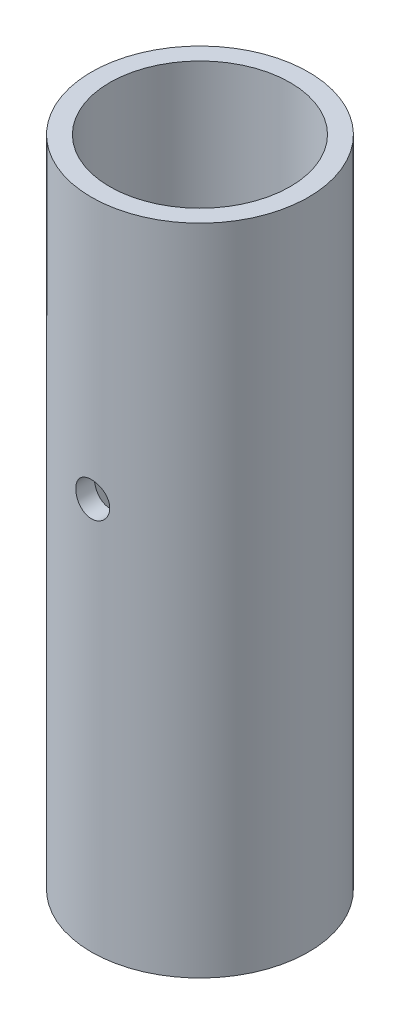
ISO-10303-21;
HEADER;
FILE_DESCRIPTION(('STEP AP214'),'2;1');
FILE_NAME('part.step','',(''),(''),'','','');
FILE_SCHEMA(('AUTOMOTIVE_DESIGN { 1 0 10303 214 1 1 1 1 }'));
ENDSEC;
DATA;
#1=APPLICATION_CONTEXT('core data for automotive mechanical design processes');
#2=APPLICATION_PROTOCOL_DEFINITION('international standard','automotive_design',2000,#1);
#3=PRODUCT_CONTEXT('',#1,'mechanical');
#4=PRODUCT('Part','Part','',(#3));
#5=PRODUCT_RELATED_PRODUCT_CATEGORY('part','',(#4));
#6=PRODUCT_DEFINITION_FORMATION('','',#4);
#7=PRODUCT_DEFINITION_CONTEXT('part definition',#1,'design');
#8=PRODUCT_DEFINITION('design','',#6,#7);
#9=PRODUCT_DEFINITION_SHAPE('','',#8);
#10=(LENGTH_UNIT() NAMED_UNIT(*) SI_UNIT(.MILLI.,.METRE.));
#11=(NAMED_UNIT(*) PLANE_ANGLE_UNIT() SI_UNIT($,.RADIAN.));
#12=(NAMED_UNIT(*) SI_UNIT($,.STERADIAN.) SOLID_ANGLE_UNIT());
#13=UNCERTAINTY_MEASURE_WITH_UNIT(LENGTH_MEASURE(1.E-05),#10,'distance_accuracy_value','');
#14=(GEOMETRIC_REPRESENTATION_CONTEXT(3) GLOBAL_UNCERTAINTY_ASSIGNED_CONTEXT((#13)) GLOBAL_UNIT_ASSIGNED_CONTEXT((#10,
#11,#12)) REPRESENTATION_CONTEXT('',''));
#15=CARTESIAN_POINT('',(0.,0.,0.));
#16=DIRECTION('',(0.,0.,1.));
#17=DIRECTION('',(1.,0.,0.));
#18=AXIS2_PLACEMENT_3D('',#15,#16,#17);
#19=CARTESIAN_POINT('',(0.,76.2,25.2984));
#20=DIRECTION('',(0.,0.,-1.));
#21=DIRECTION('',(-1.,0.,0.));
#22=AXIS2_PLACEMENT_3D('',#19,#20,#21);
#23=CYLINDRICAL_SURFACE('',#22,3.302);
#24=CARTESIAN_POINT('',(3.302,76.2,17.212131535635));
#25=CARTESIAN_POINT('',(3.30199130007002,76.0164871813546,17.2121357912959));
#26=CARTESIAN_POINT('',(3.28663585313906,75.8327439878626,17.2151010141485));
#27=CARTESIAN_POINT('',(3.22562147458273,75.4702961854619,17.2266354162427));
#28=CARTESIAN_POINT('',(3.17990188170017,75.2916024107881,17.235215812932));
#29=CARTESIAN_POINT('',(3.05960981849083,74.9447641031004,17.2569745758185));
#30=CARTESIAN_POINT('',(2.98507722350842,74.776605362395,17.2701465850535));
#31=CARTESIAN_POINT('',(2.80936907233875,74.4552393196757,17.2995959096477));
#32=CARTESIAN_POINT('',(2.70820265297164,74.3020269149291,17.3158721595603));
#33=CARTESIAN_POINT('',(2.48072155818345,74.0128922096604,17.3499290051584));
#34=CARTESIAN_POINT('',(2.35413406488901,73.8771862687002,17.3677245991603));
#35=CARTESIAN_POINT('',(2.07998787720683,73.6287991620913,17.4026833164607));
#36=CARTESIAN_POINT('',(1.93242669927012,73.5161207270474,17.4198463645542));
#37=CARTESIAN_POINT('',(1.61912172583027,73.3161758225405,17.4517639888191));
#38=CARTESIAN_POINT('',(1.45324708551853,73.2291110024161,17.4664990714187));
#39=CARTESIAN_POINT('',(1.10890232271858,73.0841652145225,17.4917344998527));
#40=CARTESIAN_POINT('',(0.930433354973723,73.0262815751546,17.5022352333331));
#41=CARTESIAN_POINT('',(0.568185677153312,72.9420031161057,17.5177140797912));
#42=CARTESIAN_POINT('',(0.384493776564784,72.9152469916724,17.5227555116936));
#43=CARTESIAN_POINT('',(0.0151634313080578,72.8928572174964,17.5269660010195));
#44=CARTESIAN_POINT('',(-0.170474847849683,72.8972209425663,17.526135553779));
#45=CARTESIAN_POINT('',(-0.535948321762245,72.9366700400711,17.5187453165642));
#46=CARTESIAN_POINT('',(-0.715827218444372,72.9713661073525,17.5122581315663));
#47=CARTESIAN_POINT('',(-1.06716471944178,73.0698796318034,17.4943647240374));
#48=CARTESIAN_POINT('',(-1.23862294887289,73.1336983842019,17.4829582827243));
#49=CARTESIAN_POINT('',(-1.56938357210161,73.2890182445264,17.4563863678042));
#50=CARTESIAN_POINT('',(-1.72861081598389,73.3806756240815,17.4411997634979));
#51=CARTESIAN_POINT('',(-2.02955810161077,73.588948478513,17.4087481619631));
#52=CARTESIAN_POINT('',(-2.1712776543047,73.7055646503267,17.3914831067029));
#53=CARTESIAN_POINT('',(-2.4354828311894,73.9625666232612,17.35647319222));
#54=CARTESIAN_POINT('',(-2.55764096472366,74.1032888322442,17.3387250336484));
#55=CARTESIAN_POINT('',(-2.77672597148959,74.4034676115724,17.3049934941075));
#56=CARTESIAN_POINT('',(-2.87364158354753,74.5629324975044,17.2890109026162));
#57=CARTESIAN_POINT('',(-3.03957910177399,74.8965509753187,17.2606131954961));
#58=CARTESIAN_POINT('',(-3.10853019051617,75.0707405259617,17.248207159813));
#59=CARTESIAN_POINT('',(-3.21595739527462,75.4282930881176,17.2285032482303));
#60=CARTESIAN_POINT('',(-3.25449780559778,75.6116358699164,17.2211945992487));
#61=CARTESIAN_POINT('',(-3.2855165099523,75.8636254808596,17.2152867144043));
#62=CARTESIAN_POINT('',(-3.29169262178811,75.9307373186883,17.2141062438161));
#63=CARTESIAN_POINT('',(-3.29993596755384,76.0652224108313,17.2125278723074));
#64=CARTESIAN_POINT('',(-3.30200319548789,76.132595665527,17.2121299725289));
#65=CARTESIAN_POINT('',(-3.30199130007002,76.3835128186454,17.2121357912959));
#66=CARTESIAN_POINT('',(-3.28663585313906,76.5672560121374,17.2151010141485));
#67=CARTESIAN_POINT('',(-3.22562147458273,76.9297038145381,17.2266354162427));
#68=CARTESIAN_POINT('',(-3.17990188170017,77.1083975892119,17.235215812932));
#69=CARTESIAN_POINT('',(-3.05960981849083,77.4552358968996,17.2569745758185));
#70=CARTESIAN_POINT('',(-2.98507722350842,77.623394637605,17.2701465850535));
#71=CARTESIAN_POINT('',(-2.80936907233875,77.9447606803243,17.2995959096477));
#72=CARTESIAN_POINT('',(-2.70820265297164,78.0979730850709,17.3158721595603));
#73=CARTESIAN_POINT('',(-2.48072155818345,78.3871077903396,17.3499290051584));
#74=CARTESIAN_POINT('',(-2.35413406488901,78.5228137312997,17.3677245991603));
#75=CARTESIAN_POINT('',(-2.07998787720683,78.7712008379087,17.4026833164607));
#76=CARTESIAN_POINT('',(-1.93242669927012,78.8838792729526,17.4198463645542));
#77=CARTESIAN_POINT('',(-1.61912172583027,79.0838241774595,17.4517639888191));
#78=CARTESIAN_POINT('',(-1.45324708551853,79.1708889975839,17.4664990714187));
#79=CARTESIAN_POINT('',(-1.10890232271858,79.3158347854775,17.4917344998527));
#80=CARTESIAN_POINT('',(-0.930433354973723,79.3737184248454,17.5022352333331));
#81=CARTESIAN_POINT('',(-0.568185677153312,79.4579968838943,17.5177140797912));
#82=CARTESIAN_POINT('',(-0.384493776564784,79.4847530083275,17.5227555116936));
#83=CARTESIAN_POINT('',(-0.015163431308058,79.5071427825036,17.5269660010195));
#84=CARTESIAN_POINT('',(0.170474847849683,79.5027790574336,17.526135553779));
#85=CARTESIAN_POINT('',(0.535948321762244,79.4633299599289,17.5187453165642));
#86=CARTESIAN_POINT('',(0.71582721844437,79.4286338926475,17.5122581315663));
#87=CARTESIAN_POINT('',(1.06716471944178,79.3301203681966,17.4943647240374));
#88=CARTESIAN_POINT('',(1.23862294887289,79.2663016157981,17.4829582827243));
#89=CARTESIAN_POINT('',(1.56938357210161,79.1109817554736,17.4563863678042));
#90=CARTESIAN_POINT('',(1.72861081598389,79.0193243759185,17.4411997634979));
#91=CARTESIAN_POINT('',(2.02955810161077,78.811051521487,17.4087481619631));
#92=CARTESIAN_POINT('',(2.1712776543047,78.6944353496733,17.3914831067029));
#93=CARTESIAN_POINT('',(2.4354828311894,78.4374333767388,17.35647319222));
#94=CARTESIAN_POINT('',(2.55764096472366,78.2967111677557,17.3387250336484));
#95=CARTESIAN_POINT('',(2.77672597148959,77.9965323884276,17.3049934941075));
#96=CARTESIAN_POINT('',(2.87364158354753,77.8370675024956,17.2890109026162));
#97=CARTESIAN_POINT('',(3.03957910177399,77.5034490246813,17.2606131954961));
#98=CARTESIAN_POINT('',(3.10853019051617,77.3292594740383,17.248207159813));
#99=CARTESIAN_POINT('',(3.21595739527462,76.9717069118823,17.2285032482303));
#100=CARTESIAN_POINT('',(3.25449780559778,76.7883641300836,17.2211945992487));
#101=CARTESIAN_POINT('',(3.2855165099523,76.5363745191404,17.2152867144043));
#102=CARTESIAN_POINT('',(3.29169262178811,76.4692626813117,17.2141062438161));
#103=CARTESIAN_POINT('',(3.29993596755384,76.3347775891687,17.2125278723074));
#104=CARTESIAN_POINT('',(3.30200319548789,76.267404334473,17.2121299725289));
#105=CARTESIAN_POINT('',(3.302,76.2,17.212131535635));
#106=B_SPLINE_CURVE_WITH_KNOTS('',3,(#24,#25,#26,#27,#28,#29,#30,#31,#32,#33,#34,#35,#36,#37,
#38,#39,#40,#41,#42,#43,#44,#45,#46,#47,#48,#49,#50,#51,#52,#53,#54,#55,#56,#57,#58,#59,#60,#61,
#62,#63,#64,#65,#66,#67,#68,#69,#70,#71,#72,#73,#74,#75,#76,#77,#78,#79,#80,#81,#82,#83,#84,#85,
#86,#87,#88,#89,#90,#91,#92,#93,#94,#95,#96,#97,#98,#99,#100,#101,#102,#103,#104,#105),
.UNSPECIFIED.,.T.,.F.,(4,2,2,2,2,2,2,2,2,2,2,2,2,2,2,2,2,2,2,2,2,2,2,2,2,2,2,2,2,2,2,2,2,2,2,2,
2,2,2,2,4),(0.,0.550280728118776,1.1016641231347,1.65228715504278,2.20272153951086,
2.75941341573735,3.31617126630994,3.87720172279344,4.4381808064211,4.99258136898155,
5.5469351643474,6.0942767793971,6.64164273979224,7.19213997066774,7.74265257536888,
8.30158887354543,8.86077409849182,9.42136669374738,9.98077088361991,10.1828889285657,
10.3850072684503,10.9352879965691,11.486671391585,12.0372944234931,12.5877288079612,
13.1444206841877,13.7011785347603,14.2622089912438,14.8231880748714,15.3775886374319,
15.9319424327977,16.4792840478474,17.0266500082426,17.5771472391181,18.1276598438192,
18.6865961419958,19.2457813669421,19.8063739621977,20.3657781520702,20.567896197016,
20.7700145369006),.UNSPECIFIED.);
#107=CARTESIAN_POINT('',(3.302,76.2,17.212131535635));
#108=VERTEX_POINT('',#107);
#109=EDGE_CURVE('E19',#108,#108,#106,.T.);
#110=ORIENTED_EDGE('',*,*,#109,.T.);
#111=EDGE_LOOP('',(#110));
#112=FACE_BOUND('',#111,.T.);
#113=CARTESIAN_POINT('',(-3.302,76.2,20.8218039564299));
#114=CARTESIAN_POINT('',(-3.30199160753357,76.3840729881841,20.8218073806267));
#115=CARTESIAN_POINT('',(-3.28654301260894,76.5683826280437,20.8242733684239));
#116=CARTESIAN_POINT('',(-3.22514065789151,76.9319773809362,20.8338695525104));
#117=CARTESIAN_POINT('',(-3.17912451730725,77.1112514361911,20.8410092863234));
#118=CARTESIAN_POINT('',(-3.05799853788291,77.4592582036655,20.8591249107495));
#119=CARTESIAN_POINT('',(-2.9829239644666,77.6280034065927,20.870096149862));
#120=CARTESIAN_POINT('',(-2.80588978432558,77.9504319595423,20.8946321673489));
#121=CARTESIAN_POINT('',(-2.7039404616579,78.104121040242,20.9081959530987));
#122=CARTESIAN_POINT('',(-2.47508070345098,78.3935072758243,20.9365245741082));
#123=CARTESIAN_POINT('',(-2.34797939326253,78.5290526638276,20.9512980530242));
#124=CARTESIAN_POINT('',(-2.07283012487502,78.7769904673666,20.9803050551998));
#125=CARTESIAN_POINT('',(-1.92477991142582,78.8893803869011,20.9945385201148));
#126=CARTESIAN_POINT('',(-1.6109795917043,79.0883630305796,21.0209503025573));
#127=CARTESIAN_POINT('',(-1.44514095474079,79.1748177447445,21.0331174809926));
#128=CARTESIAN_POINT('',(-1.10107506605374,79.3185885256555,21.05393135813));
#129=CARTESIAN_POINT('',(-0.922848635277752,79.3759065212229,21.0625782898611));
#130=CARTESIAN_POINT('',(-0.560609603386695,79.4593222998533,21.0753173636847));
#131=CARTESIAN_POINT('',(-0.376656148144354,79.4856712441195,21.0794461292818));
#132=CARTESIAN_POINT('',(-0.00689553053005387,79.5071812576626,21.0828093145542));
#133=CARTESIAN_POINT('',(0.178911522424525,79.5023441570935,21.0820440214374));
#134=CARTESIAN_POINT('',(0.545387987681637,79.4618167775211,21.07573448412));
#135=CARTESIAN_POINT('',(0.726088139323015,79.4263970120159,21.0702321418829));
#136=CARTESIAN_POINT('',(1.07894959112666,79.3261343568065,21.0551133735714));
#137=CARTESIAN_POINT('',(1.25111058419742,79.261290409778,21.0454967996575));
#138=CARTESIAN_POINT('',(1.58282366581658,79.1037438111656,21.0231579611584));
#139=CARTESIAN_POINT('',(1.74232079287567,79.0109273061887,21.0104230448454));
#140=CARTESIAN_POINT('',(2.04356567709641,78.8001612752758,20.983266477008));
#141=CARTESIAN_POINT('',(2.18531354855578,78.6822119111981,20.9688448363465));
#142=CARTESIAN_POINT('',(2.44862169860154,78.4230472614397,20.9397407137842));
#143=CARTESIAN_POINT('',(2.56995357233259,78.2815999631653,20.925057084518));
#144=CARTESIAN_POINT('',(2.78725086621637,77.9801582635446,20.8972247356282));
#145=CARTESIAN_POINT('',(2.8832048216977,77.8201555264266,20.8840767112186));
#146=CARTESIAN_POINT('',(3.04705056434819,77.4858532883372,20.8608028211873));
#147=CARTESIAN_POINT('',(3.11489418988142,77.3115298587399,20.8506821505325));
#148=CARTESIAN_POINT('',(3.22013679209878,76.9539992542655,20.8346903229562));
#149=CARTESIAN_POINT('',(3.25760012468806,76.7708117341165,20.828810186069));
#150=CARTESIAN_POINT('',(3.28690487349376,76.5219300514406,20.8241928990953));
#151=CARTESIAN_POINT('',(3.29256105712587,76.4576857182853,20.8232989883506));
#152=CARTESIAN_POINT('',(3.30011009230049,76.3289706091185,20.8221039168489));
#153=CARTESIAN_POINT('',(3.30200294075023,76.2644998329209,20.8218027565791));
#154=CARTESIAN_POINT('',(3.30199160753357,76.0159270118159,20.8218073806267));
#155=CARTESIAN_POINT('',(3.28654301260894,75.8316173719563,20.8242733684239));
#156=CARTESIAN_POINT('',(3.22514065789151,75.4680226190638,20.8338695525104));
#157=CARTESIAN_POINT('',(3.17912451730725,75.2887485638089,20.8410092863234));
#158=CARTESIAN_POINT('',(3.05799853788291,74.9407417963344,20.8591249107495));
#159=CARTESIAN_POINT('',(2.9829239644666,74.7719965934073,20.870096149862));
#160=CARTESIAN_POINT('',(2.80588978432558,74.4495680404577,20.8946321673489));
#161=CARTESIAN_POINT('',(2.7039404616579,74.2958789597579,20.9081959530987));
#162=CARTESIAN_POINT('',(2.47508070345098,74.0064927241757,20.9365245741082));
#163=CARTESIAN_POINT('',(2.34797939326253,73.8709473361724,20.9512980530242));
#164=CARTESIAN_POINT('',(2.07283012487502,73.6230095326334,20.9803050551998));
#165=CARTESIAN_POINT('',(1.92477991142582,73.5106196130989,20.9945385201148));
#166=CARTESIAN_POINT('',(1.6109795917043,73.3116369694203,21.0209503025573));
#167=CARTESIAN_POINT('',(1.44514095474079,73.2251822552555,21.0331174809926));
#168=CARTESIAN_POINT('',(1.10107506605374,73.0814114743445,21.05393135813));
#169=CARTESIAN_POINT('',(0.922848635277752,73.024093478777,21.0625782898611));
#170=CARTESIAN_POINT('',(0.560609603386695,72.9406777001467,21.0753173636847));
#171=CARTESIAN_POINT('',(0.376656148144354,72.9143287558805,21.0794461292818));
#172=CARTESIAN_POINT('',(0.00689553053005382,72.8928187423374,21.0828093145542));
#173=CARTESIAN_POINT('',(-0.178911522424526,72.8976558429065,21.0820440214374));
#174=CARTESIAN_POINT('',(-0.545387987681637,72.9381832224789,21.07573448412));
#175=CARTESIAN_POINT('',(-0.726088139323015,72.9736029879841,21.0702321418829));
#176=CARTESIAN_POINT('',(-1.07894959112666,73.0738656431935,21.0551133735714));
#177=CARTESIAN_POINT('',(-1.25111058419742,73.1387095902219,21.0454967996575));
#178=CARTESIAN_POINT('',(-1.58282366581658,73.2962561888343,21.0231579611584));
#179=CARTESIAN_POINT('',(-1.74232079287567,73.3890726938112,21.0104230448454));
#180=CARTESIAN_POINT('',(-2.04356567709641,73.5998387247241,20.983266477008));
#181=CARTESIAN_POINT('',(-2.18531354855578,73.7177880888019,20.9688448363465));
#182=CARTESIAN_POINT('',(-2.44862169860154,73.9769527385603,20.9397407137842));
#183=CARTESIAN_POINT('',(-2.5699535723326,74.1184000368347,20.925057084518));
#184=CARTESIAN_POINT('',(-2.78725086621637,74.4198417364553,20.8972247356282));
#185=CARTESIAN_POINT('',(-2.8832048216977,74.5798444735734,20.8840767112186));
#186=CARTESIAN_POINT('',(-3.04705056434819,74.9141467116628,20.8608028211873));
#187=CARTESIAN_POINT('',(-3.11489418988142,75.0884701412601,20.8506821505325));
#188=CARTESIAN_POINT('',(-3.22013679209878,75.4460007457345,20.8346903229562));
#189=CARTESIAN_POINT('',(-3.25760012468806,75.6291882658835,20.828810186069));
#190=CARTESIAN_POINT('',(-3.28690487349376,75.8780699485594,20.8241928990953));
#191=CARTESIAN_POINT('',(-3.29256105712587,75.9423142817147,20.8232989883506));
#192=CARTESIAN_POINT('',(-3.30011009230049,76.0710293908815,20.822103916849));
#193=CARTESIAN_POINT('',(-3.30200294075023,76.1355001670791,20.8218027565791));
#194=CARTESIAN_POINT('',(-3.302,76.2,20.8218039564299));
#195=B_SPLINE_CURVE_WITH_KNOTS('',3,(#113,#114,#115,#116,#117,#118,#119,#120,#121,#122,#123,
#124,#125,#126,#127,#128,#129,#130,#131,#132,#133,#134,#135,#136,#137,#138,#139,#140,#141,#142,
#143,#144,#145,#146,#147,#148,#149,#150,#151,#152,#153,#154,#155,#156,#157,#158,#159,#160,#161,
#162,#163,#164,#165,#166,#167,#168,#169,#170,#171,#172,#173,#174,#175,#176,#177,#178,#179,#180,
#181,#182,#183,#184,#185,#186,#187,#188,#189,#190,#191,#192,#193,#194),.UNSPECIFIED.,.T.,.F.,(4,
2,2,2,2,2,2,2,2,2,2,2,2,2,2,2,2,2,2,2,2,2,2,2,2,2,2,2,2,2,2,2,2,2,2,2,2,2,2,2,4),(0.,
0.55197278689678,1.10507548841285,1.65750903647682,2.20973149302041,2.76631755972952,
3.32296359125632,3.88252122115703,4.44204180408307,4.99699261923523,5.5519108673788,
6.10197039090308,6.652049681752,7.20439884684058,7.75674445485043,8.31490894049801,
8.87332515223377,9.43269418546172,9.99087516451011,10.1842882427925,10.3777014800249,
10.9296742669216,11.4827769684377,12.0352105165017,12.5874329730453,13.1440190397544,
13.7006650712812,14.2602227011819,14.8197432841079,15.3746940992601,15.9296123474037,
16.4796718709279,17.0297511617769,17.5821003268654,18.1344459348753,18.6926104205229,
19.2510266322586,19.8103956654866,20.368576644535,20.5619897228173,20.7554029600497),.UNSPECIFIED.);
#196=CARTESIAN_POINT('',(-3.302,76.2,20.8218039564299));
#197=VERTEX_POINT('',#196);
#198=EDGE_CURVE('E46',#197,#197,#195,.T.);
#199=ORIENTED_EDGE('',*,*,#198,.F.);
#200=EDGE_LOOP('',(#199));
#201=FACE_BOUND('',#200,.T.);
#202=ADVANCED_FACE('F15',(#112,#201),#23,.F.);
#203=CARTESIAN_POINT('',(0.,0.,0.));
#204=DIRECTION('',(0.,1.,0.));
#205=DIRECTION('',(0.,0.,1.));
#206=AXIS2_PLACEMENT_3D('',#203,#204,#205);
#207=CYLINDRICAL_SURFACE('',#206,17.526);
#208=CARTESIAN_POINT('',(0.,127.,0.));
#209=DIRECTION('',(0.,1.,0.));
#210=DIRECTION('',(0.,0.,1.));
#211=AXIS2_PLACEMENT_3D('',#208,#209,#210);
#212=CIRCLE('',#211,17.526);
#213=CARTESIAN_POINT('',(0.,127.,17.526));
#214=VERTEX_POINT('',#213);
#215=EDGE_CURVE('E52',#214,#214,#212,.F.);
#216=ORIENTED_EDGE('',*,*,#215,.F.);
#217=EDGE_LOOP('',(#216));
#218=FACE_BOUND('',#217,.T.);
#219=CARTESIAN_POINT('',(3.302,76.2,-17.212131535635));
#220=CARTESIAN_POINT('',(3.30199130007002,76.0164871813546,-17.2121357912959));
#221=CARTESIAN_POINT('',(3.28663585313906,75.8327439878626,-17.2151010141485));
#222=CARTESIAN_POINT('',(3.22562147458273,75.4702961854619,-17.2266354162427));
#223=CARTESIAN_POINT('',(3.17990188170017,75.2916024107881,-17.235215812932));
#224=CARTESIAN_POINT('',(3.05960981849083,74.9447641031004,-17.2569745758185));
#225=CARTESIAN_POINT('',(2.98507722350842,74.776605362395,-17.2701465850535));
#226=CARTESIAN_POINT('',(2.80936907233875,74.4552393196757,-17.2995959096477));
#227=CARTESIAN_POINT('',(2.70820265297164,74.3020269149291,-17.3158721595603));
#228=CARTESIAN_POINT('',(2.48072155818345,74.0128922096604,-17.3499290051584));
#229=CARTESIAN_POINT('',(2.35413406488901,73.8771862687002,-17.3677245991603));
#230=CARTESIAN_POINT('',(2.07998787720683,73.6287991620913,-17.4026833164607));
#231=CARTESIAN_POINT('',(1.93242669927012,73.5161207270474,-17.4198463645542));
#232=CARTESIAN_POINT('',(1.61912172583027,73.3161758225405,-17.4517639888191));
#233=CARTESIAN_POINT('',(1.45324708551853,73.2291110024161,-17.4664990714187));
#234=CARTESIAN_POINT('',(1.10890232271858,73.0841652145225,-17.4917344998527));
#235=CARTESIAN_POINT('',(0.930433354973723,73.0262815751546,-17.5022352333331));
#236=CARTESIAN_POINT('',(0.568185677153312,72.9420031161057,-17.5177140797912));
#237=CARTESIAN_POINT('',(0.384493776564784,72.9152469916724,-17.5227555116936));
#238=CARTESIAN_POINT('',(0.0151634313080578,72.8928572174964,-17.5269660010195));
#239=CARTESIAN_POINT('',(-0.170474847849683,72.8972209425663,-17.526135553779));
#240=CARTESIAN_POINT('',(-0.535948321762245,72.9366700400711,-17.5187453165642));
#241=CARTESIAN_POINT('',(-0.715827218444372,72.9713661073525,-17.5122581315663));
#242=CARTESIAN_POINT('',(-1.06716471944178,73.0698796318034,-17.4943647240374));
#243=CARTESIAN_POINT('',(-1.23862294887289,73.1336983842019,-17.4829582827243));
#244=CARTESIAN_POINT('',(-1.56938357210161,73.2890182445264,-17.4563863678042));
#245=CARTESIAN_POINT('',(-1.72861081598389,73.3806756240815,-17.4411997634979));
#246=CARTESIAN_POINT('',(-2.02955810161077,73.588948478513,-17.4087481619631));
#247=CARTESIAN_POINT('',(-2.1712776543047,73.7055646503267,-17.3914831067029));
#248=CARTESIAN_POINT('',(-2.4354828311894,73.9625666232612,-17.35647319222));
#249=CARTESIAN_POINT('',(-2.55764096472366,74.1032888322442,-17.3387250336484));
#250=CARTESIAN_POINT('',(-2.77672597148959,74.4034676115724,-17.3049934941075));
#251=CARTESIAN_POINT('',(-2.87364158354753,74.5629324975044,-17.2890109026162));
#252=CARTESIAN_POINT('',(-3.03957910177399,74.8965509753187,-17.2606131954961));
#253=CARTESIAN_POINT('',(-3.10853019051617,75.0707405259617,-17.248207159813));
#254=CARTESIAN_POINT('',(-3.21595739527462,75.4282930881176,-17.2285032482303));
#255=CARTESIAN_POINT('',(-3.25449780559778,75.6116358699164,-17.2211945992487));
#256=CARTESIAN_POINT('',(-3.2855165099523,75.8636254808596,-17.2152867144043));
#257=CARTESIAN_POINT('',(-3.29169262178811,75.9307373186883,-17.2141062438161));
#258=CARTESIAN_POINT('',(-3.29993596755384,76.0652224108313,-17.2125278723074));
#259=CARTESIAN_POINT('',(-3.30200319548789,76.132595665527,-17.2121299725289));
#260=CARTESIAN_POINT('',(-3.30199130007002,76.3835128186454,-17.2121357912959));
#261=CARTESIAN_POINT('',(-3.28663585313906,76.5672560121374,-17.2151010141485));
#262=CARTESIAN_POINT('',(-3.22562147458273,76.9297038145381,-17.2266354162427));
#263=CARTESIAN_POINT('',(-3.17990188170017,77.1083975892119,-17.235215812932));
#264=CARTESIAN_POINT('',(-3.05960981849083,77.4552358968996,-17.2569745758185));
#265=CARTESIAN_POINT('',(-2.98507722350842,77.623394637605,-17.2701465850535));
#266=CARTESIAN_POINT('',(-2.80936907233875,77.9447606803243,-17.2995959096477));
#267=CARTESIAN_POINT('',(-2.70820265297164,78.0979730850709,-17.3158721595603));
#268=CARTESIAN_POINT('',(-2.48072155818345,78.3871077903396,-17.3499290051584));
#269=CARTESIAN_POINT('',(-2.35413406488901,78.5228137312997,-17.3677245991603));
#270=CARTESIAN_POINT('',(-2.07998787720683,78.7712008379087,-17.4026833164607));
#271=CARTESIAN_POINT('',(-1.93242669927012,78.8838792729526,-17.4198463645542));
#272=CARTESIAN_POINT('',(-1.61912172583027,79.0838241774595,-17.4517639888191));
#273=CARTESIAN_POINT('',(-1.45324708551853,79.1708889975839,-17.4664990714187));
#274=CARTESIAN_POINT('',(-1.10890232271858,79.3158347854775,-17.4917344998527));
#275=CARTESIAN_POINT('',(-0.930433354973723,79.3737184248454,-17.5022352333331));
#276=CARTESIAN_POINT('',(-0.568185677153312,79.4579968838943,-17.5177140797912));
#277=CARTESIAN_POINT('',(-0.384493776564784,79.4847530083275,-17.5227555116936));
#278=CARTESIAN_POINT('',(-0.015163431308058,79.5071427825036,-17.5269660010195));
#279=CARTESIAN_POINT('',(0.170474847849683,79.5027790574336,-17.526135553779));
#280=CARTESIAN_POINT('',(0.535948321762244,79.4633299599289,-17.5187453165642));
#281=CARTESIAN_POINT('',(0.71582721844437,79.4286338926475,-17.5122581315663));
#282=CARTESIAN_POINT('',(1.06716471944178,79.3301203681966,-17.4943647240374));
#283=CARTESIAN_POINT('',(1.23862294887289,79.2663016157981,-17.4829582827243));
#284=CARTESIAN_POINT('',(1.56938357210161,79.1109817554736,-17.4563863678042));
#285=CARTESIAN_POINT('',(1.72861081598389,79.0193243759185,-17.4411997634979));
#286=CARTESIAN_POINT('',(2.02955810161077,78.811051521487,-17.4087481619631));
#287=CARTESIAN_POINT('',(2.1712776543047,78.6944353496733,-17.3914831067029));
#288=CARTESIAN_POINT('',(2.4354828311894,78.4374333767388,-17.35647319222));
#289=CARTESIAN_POINT('',(2.55764096472366,78.2967111677557,-17.3387250336484));
#290=CARTESIAN_POINT('',(2.77672597148959,77.9965323884276,-17.3049934941075));
#291=CARTESIAN_POINT('',(2.87364158354753,77.8370675024956,-17.2890109026162));
#292=CARTESIAN_POINT('',(3.03957910177399,77.5034490246813,-17.2606131954961));
#293=CARTESIAN_POINT('',(3.10853019051617,77.3292594740383,-17.248207159813));
#294=CARTESIAN_POINT('',(3.21595739527462,76.9717069118823,-17.2285032482303));
#295=CARTESIAN_POINT('',(3.25449780559778,76.7883641300836,-17.2211945992487));
#296=CARTESIAN_POINT('',(3.2855165099523,76.5363745191404,-17.2152867144043));
#297=CARTESIAN_POINT('',(3.29169262178811,76.4692626813117,-17.2141062438161));
#298=CARTESIAN_POINT('',(3.29993596755384,76.3347775891687,-17.2125278723074));
#299=CARTESIAN_POINT('',(3.30200319548789,76.267404334473,-17.2121299725289));
#300=CARTESIAN_POINT('',(3.302,76.2,-17.212131535635));
#301=B_SPLINE_CURVE_WITH_KNOTS('',3,(#219,#220,#221,#222,#223,#224,#225,#226,#227,#228,#229,
#230,#231,#232,#233,#234,#235,#236,#237,#238,#239,#240,#241,#242,#243,#244,#245,#246,#247,#248,
#249,#250,#251,#252,#253,#254,#255,#256,#257,#258,#259,#260,#261,#262,#263,#264,#265,#266,#267,
#268,#269,#270,#271,#272,#273,#274,#275,#276,#277,#278,#279,#280,#281,#282,#283,#284,#285,#286,
#287,#288,#289,#290,#291,#292,#293,#294,#295,#296,#297,#298,#299,#300),.UNSPECIFIED.,.T.,.F.,(4,
2,2,2,2,2,2,2,2,2,2,2,2,2,2,2,2,2,2,2,2,2,2,2,2,2,2,2,2,2,2,2,2,2,2,2,2,2,2,2,4),(0.,
0.550280728118776,1.1016641231347,1.65228715504278,2.20272153951086,2.75941341573735,
3.31617126630994,3.87720172279344,4.4381808064211,4.99258136898155,5.5469351643474,
6.0942767793971,6.64164273979224,7.19213997066774,7.74265257536888,8.30158887354543,
8.86077409849182,9.42136669374738,9.98077088361991,10.1828889285657,10.3850072684503,
10.9352879965691,11.486671391585,12.0372944234931,12.5877288079612,13.1444206841877,
13.7011785347603,14.2622089912438,14.8231880748714,15.3775886374319,15.9319424327977,
16.4792840478474,17.0266500082426,17.5771472391181,18.1276598438192,18.6865961419958,
19.2457813669421,19.8063739621977,20.3657781520702,20.567896197016,20.7700145369006),.UNSPECIFIED.);
#302=CARTESIAN_POINT('',(3.302,76.2,-17.212131535635));
#303=VERTEX_POINT('',#302);
#304=EDGE_CURVE('E76',#303,#303,#301,.T.);
#305=ORIENTED_EDGE('',*,*,#304,.T.);
#306=EDGE_LOOP('',(#305));
#307=FACE_BOUND('',#306,.T.);
#308=CARTESIAN_POINT('',(0.,0.,0.));
#309=DIRECTION('',(0.,1.,0.));
#310=DIRECTION('',(0.,0.,1.));
#311=AXIS2_PLACEMENT_3D('',#308,#309,#310);
#312=CIRCLE('',#311,17.526);
#313=CARTESIAN_POINT('',(0.,0.,17.526));
#314=VERTEX_POINT('',#313);
#315=EDGE_CURVE('E51',#314,#314,#312,.F.);
#316=ORIENTED_EDGE('',*,*,#315,.T.);
#317=EDGE_LOOP('',(#316));
#318=FACE_BOUND('',#317,.T.);
#319=ORIENTED_EDGE('',*,*,#109,.F.);
#320=EDGE_LOOP('',(#319));
#321=FACE_BOUND('',#320,.T.);
#322=ADVANCED_FACE('F62',(#218,#307,#318,#321),#207,.F.);
#323=CARTESIAN_POINT('',(0.,127.,0.));
#324=DIRECTION('',(0.,1.,0.));
#325=DIRECTION('',(0.,0.,1.));
#326=AXIS2_PLACEMENT_3D('',#323,#324,#325);
#327=PLANE('',#326);
#328=ORIENTED_EDGE('',*,*,#215,.T.);
#329=EDGE_LOOP('',(#328));
#330=FACE_BOUND('',#329,.T.);
#331=CARTESIAN_POINT('',(0.,127.,0.));
#332=DIRECTION('',(0.,1.,0.));
#333=DIRECTION('',(0.,0.,1.));
#334=AXIS2_PLACEMENT_3D('',#331,#332,#333);
#335=CIRCLE('',#334,21.082);
#336=CARTESIAN_POINT('',(0.,127.,21.082));
#337=VERTEX_POINT('',#336);
#338=EDGE_CURVE('E30',#337,#337,#335,.F.);
#339=ORIENTED_EDGE('',*,*,#338,.F.);
#340=EDGE_LOOP('',(#339));
#341=FACE_BOUND('',#340,.T.);
#342=ADVANCED_FACE('F64',(#330,#341),#327,.T.);
#343=CARTESIAN_POINT('',(0.,0.,0.));
#344=DIRECTION('',(0.,1.,0.));
#345=DIRECTION('',(0.,0.,1.));
#346=AXIS2_PLACEMENT_3D('',#343,#344,#345);
#347=PLANE('',#346);
#348=ORIENTED_EDGE('',*,*,#315,.F.);
#349=EDGE_LOOP('',(#348));
#350=FACE_BOUND('',#349,.T.);
#351=CARTESIAN_POINT('',(0.,0.,0.));
#352=DIRECTION('',(0.,1.,0.));
#353=DIRECTION('',(0.,0.,1.));
#354=AXIS2_PLACEMENT_3D('',#351,#352,#353);
#355=CIRCLE('',#354,21.082);
#356=CARTESIAN_POINT('',(0.,0.,21.082));
#357=VERTEX_POINT('',#356);
#358=EDGE_CURVE('E25',#357,#357,#355,.T.);
#359=ORIENTED_EDGE('',*,*,#358,.F.);
#360=EDGE_LOOP('',(#359));
#361=FACE_BOUND('',#360,.T.);
#362=ADVANCED_FACE('F71',(#350,#361),#347,.F.);
#363=CARTESIAN_POINT('',(0.,76.2,25.2984));
#364=DIRECTION('',(0.,0.,-1.));
#365=DIRECTION('',(-1.,0.,0.));
#366=AXIS2_PLACEMENT_3D('',#363,#364,#365);
#367=CYLINDRICAL_SURFACE('',#366,3.302);
#368=ORIENTED_EDGE('',*,*,#304,.F.);
#369=EDGE_LOOP('',(#368));
#370=FACE_BOUND('',#369,.T.);
#371=CARTESIAN_POINT('',(3.302,76.2,-20.8218039564299));
#372=CARTESIAN_POINT('',(3.30199160753357,76.3840729881841,-20.8218073806267));
#373=CARTESIAN_POINT('',(3.28654301260894,76.5683826280437,-20.8242733684239));
#374=CARTESIAN_POINT('',(3.22514065789151,76.9319773809362,-20.8338695525104));
#375=CARTESIAN_POINT('',(3.17912451730725,77.1112514361911,-20.8410092863234));
#376=CARTESIAN_POINT('',(3.05799853788291,77.4592582036655,-20.8591249107495));
#377=CARTESIAN_POINT('',(2.9829239644666,77.6280034065927,-20.870096149862));
#378=CARTESIAN_POINT('',(2.80588978432558,77.9504319595423,-20.8946321673489));
#379=CARTESIAN_POINT('',(2.7039404616579,78.104121040242,-20.9081959530987));
#380=CARTESIAN_POINT('',(2.47508070345098,78.3935072758243,-20.9365245741082));
#381=CARTESIAN_POINT('',(2.34797939326253,78.5290526638276,-20.9512980530242));
#382=CARTESIAN_POINT('',(2.07283012487502,78.7769904673666,-20.9803050551998));
#383=CARTESIAN_POINT('',(1.92477991142582,78.8893803869011,-20.9945385201148));
#384=CARTESIAN_POINT('',(1.6109795917043,79.0883630305796,-21.0209503025573));
#385=CARTESIAN_POINT('',(1.44514095474079,79.1748177447445,-21.0331174809926));
#386=CARTESIAN_POINT('',(1.10107506605374,79.3185885256555,-21.05393135813));
#387=CARTESIAN_POINT('',(0.922848635277752,79.3759065212229,-21.0625782898611));
#388=CARTESIAN_POINT('',(0.560609603386695,79.4593222998533,-21.0753173636847));
#389=CARTESIAN_POINT('',(0.376656148144354,79.4856712441195,-21.0794461292818));
#390=CARTESIAN_POINT('',(0.00689553053005387,79.5071812576626,-21.0828093145542));
#391=CARTESIAN_POINT('',(-0.178911522424525,79.5023441570935,-21.0820440214374));
#392=CARTESIAN_POINT('',(-0.545387987681637,79.4618167775211,-21.07573448412));
#393=CARTESIAN_POINT('',(-0.726088139323015,79.4263970120159,-21.0702321418829));
#394=CARTESIAN_POINT('',(-1.07894959112666,79.3261343568065,-21.0551133735714));
#395=CARTESIAN_POINT('',(-1.25111058419742,79.261290409778,-21.0454967996575));
#396=CARTESIAN_POINT('',(-1.58282366581658,79.1037438111656,-21.0231579611584));
#397=CARTESIAN_POINT('',(-1.74232079287567,79.0109273061887,-21.0104230448454));
#398=CARTESIAN_POINT('',(-2.04356567709641,78.8001612752758,-20.983266477008));
#399=CARTESIAN_POINT('',(-2.18531354855578,78.6822119111981,-20.9688448363465));
#400=CARTESIAN_POINT('',(-2.44862169860154,78.4230472614397,-20.9397407137842));
#401=CARTESIAN_POINT('',(-2.56995357233259,78.2815999631653,-20.925057084518));
#402=CARTESIAN_POINT('',(-2.78725086621637,77.9801582635446,-20.8972247356282));
#403=CARTESIAN_POINT('',(-2.8832048216977,77.8201555264266,-20.8840767112186));
#404=CARTESIAN_POINT('',(-3.04705056434819,77.4858532883372,-20.8608028211873));
#405=CARTESIAN_POINT('',(-3.11489418988142,77.3115298587399,-20.8506821505325));
#406=CARTESIAN_POINT('',(-3.22013679209878,76.9539992542655,-20.8346903229562));
#407=CARTESIAN_POINT('',(-3.25760012468806,76.7708117341165,-20.828810186069));
#408=CARTESIAN_POINT('',(-3.28690487349376,76.5219300514406,-20.8241928990953));
#409=CARTESIAN_POINT('',(-3.29256105712587,76.4576857182853,-20.8232989883506));
#410=CARTESIAN_POINT('',(-3.30011009230049,76.3289706091185,-20.8221039168489));
#411=CARTESIAN_POINT('',(-3.30200294075023,76.2644998329209,-20.8218027565791));
#412=CARTESIAN_POINT('',(-3.30199160753357,76.0159270118159,-20.8218073806267));
#413=CARTESIAN_POINT('',(-3.28654301260894,75.8316173719563,-20.8242733684239));
#414=CARTESIAN_POINT('',(-3.22514065789151,75.4680226190638,-20.8338695525104));
#415=CARTESIAN_POINT('',(-3.17912451730725,75.2887485638089,-20.8410092863234));
#416=CARTESIAN_POINT('',(-3.05799853788291,74.9407417963344,-20.8591249107495));
#417=CARTESIAN_POINT('',(-2.9829239644666,74.7719965934073,-20.870096149862));
#418=CARTESIAN_POINT('',(-2.80588978432558,74.4495680404577,-20.8946321673489));
#419=CARTESIAN_POINT('',(-2.7039404616579,74.2958789597579,-20.9081959530987));
#420=CARTESIAN_POINT('',(-2.47508070345098,74.0064927241757,-20.9365245741082));
#421=CARTESIAN_POINT('',(-2.34797939326253,73.8709473361724,-20.9512980530242));
#422=CARTESIAN_POINT('',(-2.07283012487502,73.6230095326334,-20.9803050551998));
#423=CARTESIAN_POINT('',(-1.92477991142582,73.5106196130989,-20.9945385201148));
#424=CARTESIAN_POINT('',(-1.6109795917043,73.3116369694203,-21.0209503025573));
#425=CARTESIAN_POINT('',(-1.44514095474079,73.2251822552555,-21.0331174809926));
#426=CARTESIAN_POINT('',(-1.10107506605374,73.0814114743445,-21.05393135813));
#427=CARTESIAN_POINT('',(-0.922848635277752,73.024093478777,-21.0625782898611));
#428=CARTESIAN_POINT('',(-0.560609603386695,72.9406777001467,-21.0753173636847));
#429=CARTESIAN_POINT('',(-0.376656148144354,72.9143287558805,-21.0794461292818));
#430=CARTESIAN_POINT('',(-0.00689553053005382,72.8928187423374,-21.0828093145542));
#431=CARTESIAN_POINT('',(0.178911522424526,72.8976558429065,-21.0820440214374));
#432=CARTESIAN_POINT('',(0.545387987681637,72.9381832224789,-21.07573448412));
#433=CARTESIAN_POINT('',(0.726088139323015,72.9736029879841,-21.0702321418829));
#434=CARTESIAN_POINT('',(1.07894959112666,73.0738656431935,-21.0551133735714));
#435=CARTESIAN_POINT('',(1.25111058419742,73.1387095902219,-21.0454967996575));
#436=CARTESIAN_POINT('',(1.58282366581658,73.2962561888343,-21.0231579611584));
#437=CARTESIAN_POINT('',(1.74232079287567,73.3890726938112,-21.0104230448454));
#438=CARTESIAN_POINT('',(2.04356567709641,73.5998387247241,-20.983266477008));
#439=CARTESIAN_POINT('',(2.18531354855578,73.7177880888019,-20.9688448363465));
#440=CARTESIAN_POINT('',(2.44862169860154,73.9769527385603,-20.9397407137842));
#441=CARTESIAN_POINT('',(2.5699535723326,74.1184000368347,-20.925057084518));
#442=CARTESIAN_POINT('',(2.78725086621637,74.4198417364553,-20.8972247356282));
#443=CARTESIAN_POINT('',(2.8832048216977,74.5798444735734,-20.8840767112186));
#444=CARTESIAN_POINT('',(3.04705056434819,74.9141467116628,-20.8608028211873));
#445=CARTESIAN_POINT('',(3.11489418988142,75.0884701412601,-20.8506821505325));
#446=CARTESIAN_POINT('',(3.22013679209878,75.4460007457345,-20.8346903229562));
#447=CARTESIAN_POINT('',(3.25760012468806,75.6291882658835,-20.828810186069));
#448=CARTESIAN_POINT('',(3.28690487349376,75.8780699485594,-20.8241928990953));
#449=CARTESIAN_POINT('',(3.29256105712587,75.9423142817147,-20.8232989883506));
#450=CARTESIAN_POINT('',(3.30011009230049,76.0710293908815,-20.822103916849));
#451=CARTESIAN_POINT('',(3.30200294075023,76.1355001670791,-20.8218027565791));
#452=CARTESIAN_POINT('',(3.302,76.2,-20.8218039564299));
#453=B_SPLINE_CURVE_WITH_KNOTS('',3,(#371,#372,#373,#374,#375,#376,#377,#378,#379,#380,#381,
#382,#383,#384,#385,#386,#387,#388,#389,#390,#391,#392,#393,#394,#395,#396,#397,#398,#399,#400,
#401,#402,#403,#404,#405,#406,#407,#408,#409,#410,#411,#412,#413,#414,#415,#416,#417,#418,#419,
#420,#421,#422,#423,#424,#425,#426,#427,#428,#429,#430,#431,#432,#433,#434,#435,#436,#437,#438,
#439,#440,#441,#442,#443,#444,#445,#446,#447,#448,#449,#450,#451,#452),.UNSPECIFIED.,.T.,.F.,(4,
2,2,2,2,2,2,2,2,2,2,2,2,2,2,2,2,2,2,2,2,2,2,2,2,2,2,2,2,2,2,2,2,2,2,2,2,2,2,2,4),(0.,
0.55197278689678,1.10507548841285,1.65750903647682,2.20973149302041,2.76631755972952,
3.32296359125632,3.88252122115703,4.44204180408307,4.99699261923523,5.5519108673788,
6.10197039090308,6.652049681752,7.20439884684058,7.75674445485043,8.31490894049801,
8.87332515223377,9.43269418546172,9.99087516451011,10.1842882427925,10.3777014800249,
10.9296742669216,11.4827769684377,12.0352105165017,12.5874329730453,13.1440190397544,
13.7006650712812,14.2602227011819,14.8197432841079,15.3746940992601,15.9296123474037,
16.4796718709279,17.0297511617769,17.5821003268654,18.1344459348753,18.6926104205229,
19.2510266322586,19.8103956654866,20.368576644535,20.5619897228173,20.7554029600497),.UNSPECIFIED.);
#454=CARTESIAN_POINT('',(3.302,76.2,-20.8218039564299));
#455=VERTEX_POINT('',#454);
#456=EDGE_CURVE('E10',#455,#455,#453,.T.);
#457=ORIENTED_EDGE('',*,*,#456,.F.);
#458=EDGE_LOOP('',(#457));
#459=FACE_BOUND('',#458,.T.);
#460=ADVANCED_FACE('F37',(#370,#459),#367,.F.);
#461=CARTESIAN_POINT('',(0.,0.,0.));
#462=DIRECTION('',(0.,1.,0.));
#463=DIRECTION('',(0.,0.,1.));
#464=AXIS2_PLACEMENT_3D('',#461,#462,#463);
#465=CYLINDRICAL_SURFACE('',#464,21.082);
#466=ORIENTED_EDGE('',*,*,#338,.T.);
#467=EDGE_LOOP('',(#466));
#468=FACE_BOUND('',#467,.T.);
#469=ORIENTED_EDGE('',*,*,#456,.T.);
#470=EDGE_LOOP('',(#469));
#471=FACE_BOUND('',#470,.T.);
#472=ORIENTED_EDGE('',*,*,#358,.T.);
#473=EDGE_LOOP('',(#472));
#474=FACE_BOUND('',#473,.T.);
#475=ORIENTED_EDGE('',*,*,#198,.T.);
#476=EDGE_LOOP('',(#475));
#477=FACE_BOUND('',#476,.T.);
#478=ADVANCED_FACE('F40',(#468,#471,#474,#477),#465,.T.);
#479=CLOSED_SHELL('',(#202,#322,#342,#362,#460,#478));
#480=MANIFOLD_SOLID_BREP('B1',#479);
#481=ADVANCED_BREP_SHAPE_REPRESENTATION('',(#18,#480),#14);
#482=SHAPE_DEFINITION_REPRESENTATION(#9,#481);
ENDSEC;
END-ISO-10303-21;
